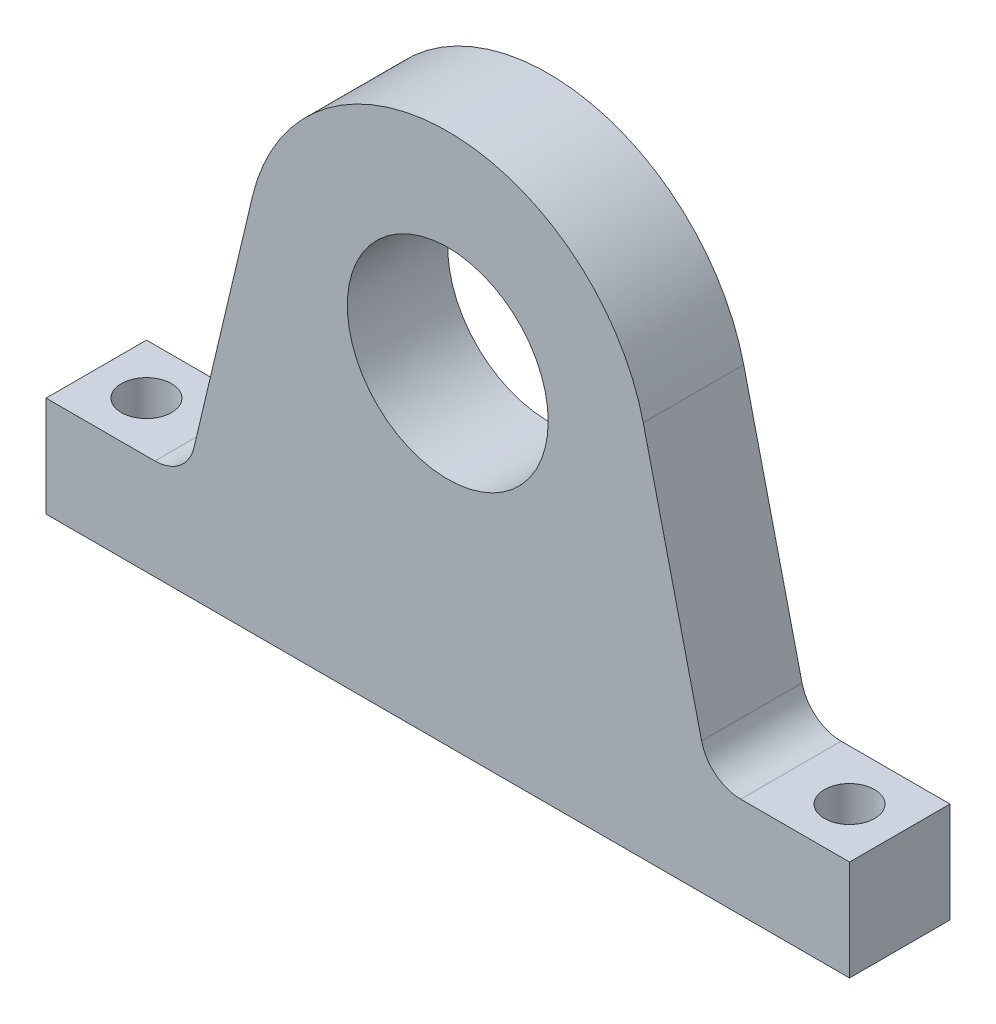
ISO-10303-21;
HEADER;
FILE_DESCRIPTION(('STEP AP214'),'2;1');
FILE_NAME('part.step','',(''),(''),'','','');
FILE_SCHEMA(('AUTOMOTIVE_DESIGN { 1 0 10303 214 1 1 1 1 }'));
ENDSEC;
DATA;
#1=APPLICATION_CONTEXT('core data for automotive mechanical design processes');
#2=APPLICATION_PROTOCOL_DEFINITION('international standard','automotive_design',2000,#1);
#3=PRODUCT_CONTEXT('',#1,'mechanical');
#4=PRODUCT('Part','Part','',(#3));
#5=PRODUCT_RELATED_PRODUCT_CATEGORY('part','',(#4));
#6=PRODUCT_DEFINITION_FORMATION('','',#4);
#7=PRODUCT_DEFINITION_CONTEXT('part definition',#1,'design');
#8=PRODUCT_DEFINITION('design','',#6,#7);
#9=PRODUCT_DEFINITION_SHAPE('','',#8);
#10=(LENGTH_UNIT() NAMED_UNIT(*) SI_UNIT(.MILLI.,.METRE.));
#11=(NAMED_UNIT(*) PLANE_ANGLE_UNIT() SI_UNIT($,.RADIAN.));
#12=(NAMED_UNIT(*) SI_UNIT($,.STERADIAN.) SOLID_ANGLE_UNIT());
#13=UNCERTAINTY_MEASURE_WITH_UNIT(LENGTH_MEASURE(1.E-05),#10,'distance_accuracy_value','');
#14=(GEOMETRIC_REPRESENTATION_CONTEXT(3) GLOBAL_UNCERTAINTY_ASSIGNED_CONTEXT((#13)) GLOBAL_UNIT_ASSIGNED_CONTEXT((#10,
#11,#12)) REPRESENTATION_CONTEXT('',''));
#15=CARTESIAN_POINT('',(0.,0.,0.));
#16=DIRECTION('',(0.,0.,1.));
#17=DIRECTION('',(1.,0.,0.));
#18=AXIS2_PLACEMENT_3D('',#15,#16,#17);
#19=CARTESIAN_POINT('',(0.,0.,12.7));
#20=DIRECTION('',(0.,0.,1.));
#21=DIRECTION('',(1.,0.,0.));
#22=AXIS2_PLACEMENT_3D('',#19,#20,#21);
#23=PLANE('',#22);
#24=DIRECTION('',(-0.230444456326789,-0.973085480596772,0.));
#25=VECTOR('',#24,1.);
#26=CARTESIAN_POINT('',(-33.0200000000001,-29.21,12.7));
#27=LINE('',#26,#25);
#28=CARTESIAN_POINT('',(-24.716371207158,5.85328919070044,12.7));
#29=VERTEX_POINT('',#28);
#30=CARTESIAN_POINT('',(-32.0941962067581,-25.3006578381401,12.7));
#31=VERTEX_POINT('',#30);
#32=EDGE_CURVE('E219',#29,#31,#27,.T.);
#33=ORIENTED_EDGE('',*,*,#32,.T.);
#34=CARTESIAN_POINT('',(-37.0374704481897,-24.13,12.7));
#35=DIRECTION('',(0.,0.,1.));
#36=DIRECTION('',(1.,0.,0.));
#37=AXIS2_PLACEMENT_3D('',#34,#35,#36);
#38=CIRCLE('',#37,5.08);
#39=CARTESIAN_POINT('',(-37.0374704481897,-29.21,12.7));
#40=VERTEX_POINT('',#39);
#41=EDGE_CURVE('E11',#31,#40,#38,.F.);
#42=ORIENTED_EDGE('',*,*,#41,.T.);
#43=DIRECTION('',(-1.,0.,0.));
#44=VECTOR('',#43,1.);
#45=CARTESIAN_POINT('',(-33.0200000000001,-29.21,12.7));
#46=LINE('',#45,#44);
#47=CARTESIAN_POINT('',(-50.8000000000001,-29.21,12.7));
#48=VERTEX_POINT('',#47);
#49=EDGE_CURVE('E116',#40,#48,#46,.T.);
#50=ORIENTED_EDGE('',*,*,#49,.T.);
#51=DIRECTION('',(0.,-1.,0.));
#52=VECTOR('',#51,1.);
#53=CARTESIAN_POINT('',(-50.8000000000001,-41.91,12.7));
#54=LINE('',#53,#52);
#55=CARTESIAN_POINT('',(-50.8000000000001,-41.91,12.7));
#56=VERTEX_POINT('',#55);
#57=EDGE_CURVE('E119',#48,#56,#54,.T.);
#58=ORIENTED_EDGE('',*,*,#57,.T.);
#59=DIRECTION('',(1.,0.,0.));
#60=VECTOR('',#59,1.);
#61=CARTESIAN_POINT('',(50.7999999999999,-41.91,12.7));
#62=LINE('',#61,#60);
#63=CARTESIAN_POINT('',(50.7999999999999,-41.91,12.7));
#64=VERTEX_POINT('',#63);
#65=EDGE_CURVE('E137',#56,#64,#62,.T.);
#66=ORIENTED_EDGE('',*,*,#65,.T.);
#67=DIRECTION('',(0.,1.,0.));
#68=VECTOR('',#67,1.);
#69=CARTESIAN_POINT('',(50.7999999999999,-41.91,12.7));
#70=LINE('',#69,#68);
#71=CARTESIAN_POINT('',(50.7999999999999,-29.21,12.7));
#72=VERTEX_POINT('',#71);
#73=EDGE_CURVE('E229',#64,#72,#70,.T.);
#74=ORIENTED_EDGE('',*,*,#73,.T.);
#75=DIRECTION('',(-1.,0.,0.));
#76=VECTOR('',#75,1.);
#77=CARTESIAN_POINT('',(50.7999999999999,-29.21,12.7));
#78=LINE('',#77,#76);
#79=CARTESIAN_POINT('',(37.0374704481895,-29.21,12.7));
#80=VERTEX_POINT('',#79);
#81=EDGE_CURVE('E173',#72,#80,#78,.T.);
#82=ORIENTED_EDGE('',*,*,#81,.T.);
#83=CARTESIAN_POINT('',(37.0374704481895,-24.13,12.7));
#84=DIRECTION('',(0.,0.,1.));
#85=DIRECTION('',(1.,0.,0.));
#86=AXIS2_PLACEMENT_3D('',#83,#84,#85);
#87=CIRCLE('',#86,5.08);
#88=CARTESIAN_POINT('',(32.0941962067579,-25.3006578381401,12.7));
#89=VERTEX_POINT('',#88);
#90=EDGE_CURVE('E164',#80,#89,#87,.F.);
#91=ORIENTED_EDGE('',*,*,#90,.T.);
#92=DIRECTION('',(-0.230444456326784,0.973085480596773,0.));
#93=VECTOR('',#92,1.);
#94=CARTESIAN_POINT('',(33.0199999999999,-29.21,12.7));
#95=LINE('',#94,#93);
#96=CARTESIAN_POINT('',(24.716371207158,5.85328919070031,12.7));
#97=VERTEX_POINT('',#96);
#98=EDGE_CURVE('E170',#89,#97,#95,.T.);
#99=ORIENTED_EDGE('',*,*,#98,.T.);
#100=CARTESIAN_POINT('',(0.,0.,12.7));
#101=DIRECTION('',(0.,0.,1.));
#102=DIRECTION('',(1.,0.,0.));
#103=AXIS2_PLACEMENT_3D('',#100,#101,#102);
#104=CIRCLE('',#103,25.4);
#105=EDGE_CURVE('E184',#97,#29,#104,.T.);
#106=ORIENTED_EDGE('',*,*,#105,.T.);
#107=EDGE_LOOP('',(#33,#42,#50,#58,#66,#74,#82,#91,#99,#106));
#108=FACE_BOUND('',#107,.T.);
#109=CARTESIAN_POINT('',(0.,0.,12.7));
#110=DIRECTION('',(0.,0.,1.));
#111=DIRECTION('',(1.,0.,0.));
#112=AXIS2_PLACEMENT_3D('',#109,#110,#111);
#113=CIRCLE('',#112,12.7);
#114=CARTESIAN_POINT('',(12.7,0.,12.7));
#115=VERTEX_POINT('',#114);
#116=EDGE_CURVE('E239',#115,#115,#113,.T.);
#117=ORIENTED_EDGE('',*,*,#116,.F.);
#118=EDGE_LOOP('',(#117));
#119=FACE_BOUND('',#118,.T.);
#120=ADVANCED_FACE('F39',(#108,#119),#23,.T.);
#121=CARTESIAN_POINT('',(0.,0.,0.));
#122=DIRECTION('',(0.,0.,1.));
#123=DIRECTION('',(1.,0.,0.));
#124=AXIS2_PLACEMENT_3D('',#121,#122,#123);
#125=PLANE('',#124);
#126=DIRECTION('',(-1.,0.,0.));
#127=VECTOR('',#126,1.);
#128=CARTESIAN_POINT('',(-33.0200000000001,-29.21,0.));
#129=LINE('',#128,#127);
#130=CARTESIAN_POINT('',(-37.0374704481897,-29.21,0.));
#131=VERTEX_POINT('',#130);
#132=CARTESIAN_POINT('',(-50.8000000000001,-29.21,0.));
#133=VERTEX_POINT('',#132);
#134=EDGE_CURVE('E140',#131,#133,#129,.T.);
#135=ORIENTED_EDGE('',*,*,#134,.F.);
#136=CARTESIAN_POINT('',(-37.0374704481897,-24.13,0.));
#137=DIRECTION('',(0.,0.,1.));
#138=DIRECTION('',(1.,0.,0.));
#139=AXIS2_PLACEMENT_3D('',#136,#137,#138);
#140=CIRCLE('',#139,5.08);
#141=CARTESIAN_POINT('',(-32.0941962067581,-25.3006578381401,0.));
#142=VERTEX_POINT('',#141);
#143=EDGE_CURVE('E48',#131,#142,#140,.T.);
#144=ORIENTED_EDGE('',*,*,#143,.T.);
#145=DIRECTION('',(-0.230444456326789,-0.973085480596772,0.));
#146=VECTOR('',#145,1.);
#147=CARTESIAN_POINT('',(-33.0200000000001,-29.21,0.));
#148=LINE('',#147,#146);
#149=CARTESIAN_POINT('',(-24.716371207158,5.85328919070044,0.));
#150=VERTEX_POINT('',#149);
#151=EDGE_CURVE('E127',#150,#142,#148,.T.);
#152=ORIENTED_EDGE('',*,*,#151,.F.);
#153=CARTESIAN_POINT('',(0.,0.,0.));
#154=DIRECTION('',(0.,0.,1.));
#155=DIRECTION('',(1.,0.,0.));
#156=AXIS2_PLACEMENT_3D('',#153,#154,#155);
#157=CIRCLE('',#156,25.4);
#158=CARTESIAN_POINT('',(24.716371207158,5.85328919070031,0.));
#159=VERTEX_POINT('',#158);
#160=EDGE_CURVE('E205',#159,#150,#157,.T.);
#161=ORIENTED_EDGE('',*,*,#160,.F.);
#162=DIRECTION('',(-0.230444456326784,0.973085480596773,0.));
#163=VECTOR('',#162,1.);
#164=CARTESIAN_POINT('',(33.0199999999999,-29.21,0.));
#165=LINE('',#164,#163);
#166=CARTESIAN_POINT('',(32.0941962067579,-25.3006578381401,0.));
#167=VERTEX_POINT('',#166);
#168=EDGE_CURVE('E194',#167,#159,#165,.T.);
#169=ORIENTED_EDGE('',*,*,#168,.F.);
#170=CARTESIAN_POINT('',(37.0374704481895,-24.13,0.));
#171=DIRECTION('',(0.,0.,1.));
#172=DIRECTION('',(1.,0.,0.));
#173=AXIS2_PLACEMENT_3D('',#170,#171,#172);
#174=CIRCLE('',#173,5.08);
#175=CARTESIAN_POINT('',(37.0374704481895,-29.21,0.));
#176=VERTEX_POINT('',#175);
#177=EDGE_CURVE('E161',#167,#176,#174,.T.);
#178=ORIENTED_EDGE('',*,*,#177,.T.);
#179=DIRECTION('',(-1.,0.,0.));
#180=VECTOR('',#179,1.);
#181=CARTESIAN_POINT('',(50.7999999999999,-29.21,0.));
#182=LINE('',#181,#180);
#183=CARTESIAN_POINT('',(50.7999999999999,-29.21,0.));
#184=VERTEX_POINT('',#183);
#185=EDGE_CURVE('E192',#184,#176,#182,.T.);
#186=ORIENTED_EDGE('',*,*,#185,.F.);
#187=DIRECTION('',(0.,1.,0.));
#188=VECTOR('',#187,1.);
#189=CARTESIAN_POINT('',(50.7999999999999,-41.91,0.));
#190=LINE('',#189,#188);
#191=CARTESIAN_POINT('',(50.7999999999999,-41.91,0.));
#192=VERTEX_POINT('',#191);
#193=EDGE_CURVE('E201',#192,#184,#190,.T.);
#194=ORIENTED_EDGE('',*,*,#193,.F.);
#195=DIRECTION('',(1.,0.,0.));
#196=VECTOR('',#195,1.);
#197=CARTESIAN_POINT('',(50.7999999999999,-41.91,0.));
#198=LINE('',#197,#196);
#199=CARTESIAN_POINT('',(-50.8000000000001,-41.91,0.));
#200=VERTEX_POINT('',#199);
#201=EDGE_CURVE('E207',#200,#192,#198,.T.);
#202=ORIENTED_EDGE('',*,*,#201,.F.);
#203=DIRECTION('',(0.,-1.,0.));
#204=VECTOR('',#203,1.);
#205=CARTESIAN_POINT('',(-50.8000000000001,-41.91,0.));
#206=LINE('',#205,#204);
#207=EDGE_CURVE('E232',#133,#200,#206,.T.);
#208=ORIENTED_EDGE('',*,*,#207,.F.);
#209=EDGE_LOOP('',(#135,#144,#152,#161,#169,#178,#186,#194,#202,#208));
#210=FACE_BOUND('',#209,.T.);
#211=CARTESIAN_POINT('',(0.,0.,0.));
#212=DIRECTION('',(0.,0.,1.));
#213=DIRECTION('',(1.,0.,0.));
#214=AXIS2_PLACEMENT_3D('',#211,#212,#213);
#215=CIRCLE('',#214,12.7);
#216=CARTESIAN_POINT('',(12.7,0.,0.));
#217=VERTEX_POINT('',#216);
#218=EDGE_CURVE('E250',#217,#217,#215,.T.);
#219=ORIENTED_EDGE('',*,*,#218,.T.);
#220=EDGE_LOOP('',(#219));
#221=FACE_BOUND('',#220,.T.);
#222=ADVANCED_FACE('F189',(#210,#221),#125,.F.);
#223=CARTESIAN_POINT('',(-33.0200000000001,-29.21,12.7));
#224=DIRECTION('',(0.,-1.,0.));
#225=DIRECTION('',(1.,0.,0.));
#226=AXIS2_PLACEMENT_3D('',#223,#224,#225);
#227=PLANE('',#226);
#228=CARTESIAN_POINT('',(-44.4499999999966,-29.21,6.35));
#229=DIRECTION('',(0.,1.,0.));
#230=DIRECTION('',(0.,0.,1.));
#231=AXIS2_PLACEMENT_3D('',#228,#229,#230);
#232=CIRCLE('',#231,3.175);
#233=CARTESIAN_POINT('',(-44.4499999999966,-29.21,9.525));
#234=VERTEX_POINT('',#233);
#235=EDGE_CURVE('E266',#234,#234,#232,.T.);
#236=ORIENTED_EDGE('',*,*,#235,.F.);
#237=EDGE_LOOP('',(#236));
#238=FACE_BOUND('',#237,.T.);
#239=ORIENTED_EDGE('',*,*,#49,.F.);
#240=DIRECTION('',(0.,0.,-1.));
#241=VECTOR('',#240,1.);
#242=CARTESIAN_POINT('',(-37.0374704481897,-29.21,0.));
#243=LINE('',#242,#241);
#244=EDGE_CURVE('E156',#40,#131,#243,.T.);
#245=ORIENTED_EDGE('',*,*,#244,.T.);
#246=ORIENTED_EDGE('',*,*,#134,.T.);
#247=DIRECTION('',(0.,0.,-1.));
#248=VECTOR('',#247,1.);
#249=CARTESIAN_POINT('',(-50.8000000000001,-29.21,12.7));
#250=LINE('',#249,#248);
#251=EDGE_CURVE('E132',#48,#133,#250,.T.);
#252=ORIENTED_EDGE('',*,*,#251,.F.);
#253=EDGE_LOOP('',(#239,#245,#246,#252));
#254=FACE_BOUND('',#253,.T.);
#255=ADVANCED_FACE('F139',(#238,#254),#227,.F.);
#256=CARTESIAN_POINT('',(-50.8000000000001,-41.91,12.7));
#257=DIRECTION('',(1.,0.,0.));
#258=DIRECTION('',(0.,0.,-1.));
#259=AXIS2_PLACEMENT_3D('',#256,#257,#258);
#260=PLANE('',#259);
#261=ORIENTED_EDGE('',*,*,#207,.T.);
#262=DIRECTION('',(0.,0.,-1.));
#263=VECTOR('',#262,1.);
#264=CARTESIAN_POINT('',(-50.8000000000001,-41.91,12.7));
#265=LINE('',#264,#263);
#266=EDGE_CURVE('E134',#56,#200,#265,.T.);
#267=ORIENTED_EDGE('',*,*,#266,.F.);
#268=ORIENTED_EDGE('',*,*,#57,.F.);
#269=ORIENTED_EDGE('',*,*,#251,.T.);
#270=EDGE_LOOP('',(#261,#267,#268,#269));
#271=FACE_BOUND('',#270,.T.);
#272=ADVANCED_FACE('F131',(#271),#260,.F.);
#273=CARTESIAN_POINT('',(50.7999999999999,-41.91,12.7));
#274=DIRECTION('',(0.,1.,0.));
#275=DIRECTION('',(-1.,0.,0.));
#276=AXIS2_PLACEMENT_3D('',#273,#274,#275);
#277=PLANE('',#276);
#278=CARTESIAN_POINT('',(-44.4499999999966,-41.91,6.35));
#279=DIRECTION('',(0.,1.,0.));
#280=DIRECTION('',(0.,0.,1.));
#281=AXIS2_PLACEMENT_3D('',#278,#279,#280);
#282=CIRCLE('',#281,3.175);
#283=CARTESIAN_POINT('',(-44.4499999999966,-41.91,9.525));
#284=VERTEX_POINT('',#283);
#285=EDGE_CURVE('E254',#284,#284,#282,.T.);
#286=ORIENTED_EDGE('',*,*,#285,.T.);
#287=EDGE_LOOP('',(#286));
#288=FACE_BOUND('',#287,.T.);
#289=CARTESIAN_POINT('',(44.4500000000034,-41.91,6.35));
#290=DIRECTION('',(0.,1.,0.));
#291=DIRECTION('',(0.,0.,1.));
#292=AXIS2_PLACEMENT_3D('',#289,#290,#291);
#293=CIRCLE('',#292,3.175);
#294=CARTESIAN_POINT('',(44.4500000000034,-41.91,9.525));
#295=VERTEX_POINT('',#294);
#296=EDGE_CURVE('E262',#295,#295,#293,.T.);
#297=ORIENTED_EDGE('',*,*,#296,.T.);
#298=EDGE_LOOP('',(#297));
#299=FACE_BOUND('',#298,.T.);
#300=ORIENTED_EDGE('',*,*,#201,.T.);
#301=DIRECTION('',(0.,0.,-1.));
#302=VECTOR('',#301,1.);
#303=CARTESIAN_POINT('',(50.7999999999999,-41.91,12.7));
#304=LINE('',#303,#302);
#305=EDGE_CURVE('E150',#64,#192,#304,.T.);
#306=ORIENTED_EDGE('',*,*,#305,.F.);
#307=ORIENTED_EDGE('',*,*,#65,.F.);
#308=ORIENTED_EDGE('',*,*,#266,.T.);
#309=EDGE_LOOP('',(#300,#306,#307,#308));
#310=FACE_BOUND('',#309,.T.);
#311=ADVANCED_FACE('F274',(#288,#299,#310),#277,.F.);
#312=CARTESIAN_POINT('',(50.7999999999999,-41.91,12.7));
#313=DIRECTION('',(-1.,0.,0.));
#314=DIRECTION('',(0.,0.,1.));
#315=AXIS2_PLACEMENT_3D('',#312,#313,#314);
#316=PLANE('',#315);
#317=ORIENTED_EDGE('',*,*,#193,.T.);
#318=DIRECTION('',(0.,0.,-1.));
#319=VECTOR('',#318,1.);
#320=CARTESIAN_POINT('',(50.7999999999999,-29.21,12.7));
#321=LINE('',#320,#319);
#322=EDGE_CURVE('E199',#72,#184,#321,.T.);
#323=ORIENTED_EDGE('',*,*,#322,.F.);
#324=ORIENTED_EDGE('',*,*,#73,.F.);
#325=ORIENTED_EDGE('',*,*,#305,.T.);
#326=EDGE_LOOP('',(#317,#323,#324,#325));
#327=FACE_BOUND('',#326,.T.);
#328=ADVANCED_FACE('F228',(#327),#316,.F.);
#329=CARTESIAN_POINT('',(50.7999999999999,-29.21,12.7));
#330=DIRECTION('',(0.,-1.,0.));
#331=DIRECTION('',(1.,0.,0.));
#332=AXIS2_PLACEMENT_3D('',#329,#330,#331);
#333=PLANE('',#332);
#334=CARTESIAN_POINT('',(44.4500000000034,-29.21,6.35));
#335=DIRECTION('',(0.,1.,0.));
#336=DIRECTION('',(0.,0.,1.));
#337=AXIS2_PLACEMENT_3D('',#334,#335,#336);
#338=CIRCLE('',#337,3.175);
#339=CARTESIAN_POINT('',(44.4500000000034,-29.21,9.525));
#340=VERTEX_POINT('',#339);
#341=EDGE_CURVE('E258',#340,#340,#338,.T.);
#342=ORIENTED_EDGE('',*,*,#341,.F.);
#343=EDGE_LOOP('',(#342));
#344=FACE_BOUND('',#343,.T.);
#345=ORIENTED_EDGE('',*,*,#185,.T.);
#346=DIRECTION('',(0.,0.,-1.));
#347=VECTOR('',#346,1.);
#348=CARTESIAN_POINT('',(37.0374704481895,-29.21,12.7));
#349=LINE('',#348,#347);
#350=EDGE_CURVE('E148',#176,#80,#349,.F.);
#351=ORIENTED_EDGE('',*,*,#350,.T.);
#352=ORIENTED_EDGE('',*,*,#81,.F.);
#353=ORIENTED_EDGE('',*,*,#322,.T.);
#354=EDGE_LOOP('',(#345,#351,#352,#353));
#355=FACE_BOUND('',#354,.T.);
#356=ADVANCED_FACE('F197',(#344,#355),#333,.F.);
#357=CARTESIAN_POINT('',(33.0199999999999,-29.21,12.7));
#358=DIRECTION('',(-0.973085480596773,-0.230444456326784,0.));
#359=DIRECTION('',(0.230444456326784,-0.973085480596773,0.));
#360=AXIS2_PLACEMENT_3D('',#357,#358,#359);
#361=PLANE('',#360);
#362=ORIENTED_EDGE('',*,*,#98,.F.);
#363=DIRECTION('',(0.,0.,-1.));
#364=VECTOR('',#363,1.);
#365=CARTESIAN_POINT('',(32.0941962067579,-25.3006578381401,0.));
#366=LINE('',#365,#364);
#367=EDGE_CURVE('E143',#89,#167,#366,.T.);
#368=ORIENTED_EDGE('',*,*,#367,.T.);
#369=ORIENTED_EDGE('',*,*,#168,.T.);
#370=DIRECTION('',(0.,0.,-1.));
#371=VECTOR('',#370,1.);
#372=CARTESIAN_POINT('',(24.716371207158,5.85328919070031,12.7));
#373=LINE('',#372,#371);
#374=EDGE_CURVE('E181',#97,#159,#373,.T.);
#375=ORIENTED_EDGE('',*,*,#374,.F.);
#376=EDGE_LOOP('',(#362,#368,#369,#375));
#377=FACE_BOUND('',#376,.T.);
#378=ADVANCED_FACE('F178',(#377),#361,.F.);
#379=CARTESIAN_POINT('',(0.,0.,12.7));
#380=DIRECTION('',(0.,0.,-1.));
#381=DIRECTION('',(-1.,0.,0.));
#382=AXIS2_PLACEMENT_3D('',#379,#380,#381);
#383=CYLINDRICAL_SURFACE('',#382,25.4);
#384=ORIENTED_EDGE('',*,*,#160,.T.);
#385=DIRECTION('',(0.,0.,-1.));
#386=VECTOR('',#385,1.);
#387=CARTESIAN_POINT('',(-24.716371207158,5.85328919070044,12.7));
#388=LINE('',#387,#386);
#389=EDGE_CURVE('E215',#29,#150,#388,.T.);
#390=ORIENTED_EDGE('',*,*,#389,.F.);
#391=ORIENTED_EDGE('',*,*,#105,.F.);
#392=ORIENTED_EDGE('',*,*,#374,.T.);
#393=EDGE_LOOP('',(#384,#390,#391,#392));
#394=FACE_BOUND('',#393,.T.);
#395=ADVANCED_FACE('F303',(#394),#383,.T.);
#396=CARTESIAN_POINT('',(-33.0200000000001,-29.21,12.7));
#397=DIRECTION('',(0.973085480596772,-0.230444456326789,0.));
#398=DIRECTION('',(0.230444456326789,0.973085480596772,0.));
#399=AXIS2_PLACEMENT_3D('',#396,#397,#398);
#400=PLANE('',#399);
#401=ORIENTED_EDGE('',*,*,#151,.T.);
#402=DIRECTION('',(0.,0.,-1.));
#403=VECTOR('',#402,1.);
#404=CARTESIAN_POINT('',(-32.0941962067581,-25.3006578381401,12.7));
#405=LINE('',#404,#403);
#406=EDGE_CURVE('E55',#142,#31,#405,.F.);
#407=ORIENTED_EDGE('',*,*,#406,.T.);
#408=ORIENTED_EDGE('',*,*,#32,.F.);
#409=ORIENTED_EDGE('',*,*,#389,.T.);
#410=EDGE_LOOP('',(#401,#407,#408,#409));
#411=FACE_BOUND('',#410,.T.);
#412=ADVANCED_FACE('F300',(#411),#400,.F.);
#413=CARTESIAN_POINT('',(0.,0.,12.7));
#414=DIRECTION('',(0.,0.,-1.));
#415=DIRECTION('',(-1.,0.,0.));
#416=AXIS2_PLACEMENT_3D('',#413,#414,#415);
#417=CYLINDRICAL_SURFACE('',#416,12.7);
#418=ORIENTED_EDGE('',*,*,#116,.T.);
#419=EDGE_LOOP('',(#418));
#420=FACE_BOUND('',#419,.T.);
#421=ORIENTED_EDGE('',*,*,#218,.F.);
#422=EDGE_LOOP('',(#421));
#423=FACE_BOUND('',#422,.T.);
#424=ADVANCED_FACE('F297',(#420,#423),#417,.F.);
#425=CARTESIAN_POINT('',(44.4500000000034,-41.91,6.35));
#426=DIRECTION('',(0.,1.,0.));
#427=DIRECTION('',(0.,0.,1.));
#428=AXIS2_PLACEMENT_3D('',#425,#426,#427);
#429=CYLINDRICAL_SURFACE('',#428,3.175);
#430=ORIENTED_EDGE('',*,*,#296,.F.);
#431=EDGE_LOOP('',(#430));
#432=FACE_BOUND('',#431,.T.);
#433=ORIENTED_EDGE('',*,*,#341,.T.);
#434=EDGE_LOOP('',(#433));
#435=FACE_BOUND('',#434,.T.);
#436=ADVANCED_FACE('F280',(#432,#435),#429,.F.);
#437=CARTESIAN_POINT('',(-44.4499999999966,-41.91,6.35));
#438=DIRECTION('',(0.,1.,0.));
#439=DIRECTION('',(0.,0.,1.));
#440=AXIS2_PLACEMENT_3D('',#437,#438,#439);
#441=CYLINDRICAL_SURFACE('',#440,3.175);
#442=ORIENTED_EDGE('',*,*,#285,.F.);
#443=EDGE_LOOP('',(#442));
#444=FACE_BOUND('',#443,.T.);
#445=ORIENTED_EDGE('',*,*,#235,.T.);
#446=EDGE_LOOP('',(#445));
#447=FACE_BOUND('',#446,.T.);
#448=ADVANCED_FACE('F277',(#444,#447),#441,.F.);
#449=CARTESIAN_POINT('',(37.0374704481895,-24.13,12.7));
#450=DIRECTION('',(0.,0.,1.));
#451=DIRECTION('',(1.,0.,0.));
#452=AXIS2_PLACEMENT_3D('',#449,#450,#451);
#453=CYLINDRICAL_SURFACE('',#452,5.08);
#454=ORIENTED_EDGE('',*,*,#90,.F.);
#455=ORIENTED_EDGE('',*,*,#350,.F.);
#456=ORIENTED_EDGE('',*,*,#177,.F.);
#457=ORIENTED_EDGE('',*,*,#367,.F.);
#458=EDGE_LOOP('',(#454,#455,#456,#457));
#459=FACE_BOUND('',#458,.T.);
#460=ADVANCED_FACE('F186',(#459),#453,.F.);
#461=CARTESIAN_POINT('',(-37.0374704481897,-24.13,12.7));
#462=DIRECTION('',(0.,0.,1.));
#463=DIRECTION('',(1.,0.,0.));
#464=AXIS2_PLACEMENT_3D('',#461,#462,#463);
#465=CYLINDRICAL_SURFACE('',#464,5.08);
#466=ORIENTED_EDGE('',*,*,#41,.F.);
#467=ORIENTED_EDGE('',*,*,#406,.F.);
#468=ORIENTED_EDGE('',*,*,#143,.F.);
#469=ORIENTED_EDGE('',*,*,#244,.F.);
#470=EDGE_LOOP('',(#466,#467,#468,#469));
#471=FACE_BOUND('',#470,.T.);
#472=ADVANCED_FACE('F41',(#471),#465,.F.);
#473=CLOSED_SHELL('',(#120,#222,#255,#272,#311,#328,#356,#378,#395,#412,#424,#436,#448,#460,#472));
#474=MANIFOLD_SOLID_BREP('B2',#473);
#475=ADVANCED_BREP_SHAPE_REPRESENTATION('',(#18,#474),#14);
#476=SHAPE_DEFINITION_REPRESENTATION(#9,#475);
ENDSEC;
END-ISO-10303-21;
